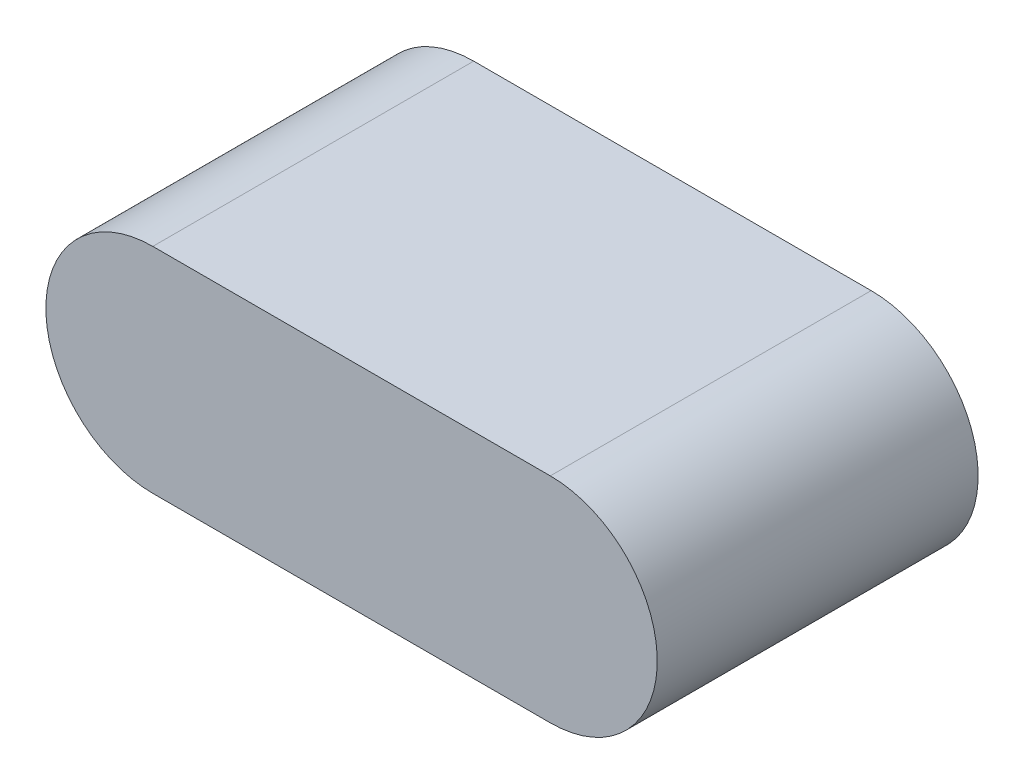
ISO-10303-21;
HEADER;
FILE_DESCRIPTION(('STEP AP214'),'2;1');
FILE_NAME('part.step','',(''),(''),'','','');
FILE_SCHEMA(('AUTOMOTIVE_DESIGN { 1 0 10303 214 1 1 1 1 }'));
ENDSEC;
DATA;
#1=APPLICATION_CONTEXT('core data for automotive mechanical design processes');
#2=APPLICATION_PROTOCOL_DEFINITION('international standard','automotive_design',2000,#1);
#3=PRODUCT_CONTEXT('',#1,'mechanical');
#4=PRODUCT('Part','Part','',(#3));
#5=PRODUCT_RELATED_PRODUCT_CATEGORY('part','',(#4));
#6=PRODUCT_DEFINITION_FORMATION('','',#4);
#7=PRODUCT_DEFINITION_CONTEXT('part definition',#1,'design');
#8=PRODUCT_DEFINITION('design','',#6,#7);
#9=PRODUCT_DEFINITION_SHAPE('','',#8);
#10=(LENGTH_UNIT() NAMED_UNIT(*) SI_UNIT(.MILLI.,.METRE.));
#11=(NAMED_UNIT(*) PLANE_ANGLE_UNIT() SI_UNIT($,.RADIAN.));
#12=(NAMED_UNIT(*) SI_UNIT($,.STERADIAN.) SOLID_ANGLE_UNIT());
#13=UNCERTAINTY_MEASURE_WITH_UNIT(LENGTH_MEASURE(1.E-05),#10,'distance_accuracy_value','');
#14=(GEOMETRIC_REPRESENTATION_CONTEXT(3) GLOBAL_UNCERTAINTY_ASSIGNED_CONTEXT((#13)) GLOBAL_UNIT_ASSIGNED_CONTEXT((#10,
#11,#12)) REPRESENTATION_CONTEXT('',''));
#15=CARTESIAN_POINT('',(0.,0.,0.));
#16=DIRECTION('',(0.,0.,1.));
#17=DIRECTION('',(1.,0.,0.));
#18=AXIS2_PLACEMENT_3D('',#15,#16,#17);
#19=CARTESIAN_POINT('',(-27.0763587627379,-14.5196168157461,3.));
#20=DIRECTION('',(0.,0.,-1.));
#21=DIRECTION('',(-1.,0.,0.));
#22=AXIS2_PLACEMENT_3D('',#19,#20,#21);
#23=CYLINDRICAL_SURFACE('',#22,1.);
#24=CARTESIAN_POINT('',(-27.0763587627379,-14.5196168157461,0.));
#25=DIRECTION('',(0.,0.,1.));
#26=DIRECTION('',(1.,0.,0.));
#27=AXIS2_PLACEMENT_3D('',#24,#25,#26);
#28=CIRCLE('',#27,1.);
#29=CARTESIAN_POINT('',(-27.0763587627379,-13.5196168157461,0.));
#30=VERTEX_POINT('',#29);
#31=CARTESIAN_POINT('',(-27.0763587627379,-15.5196168157461,0.));
#32=VERTEX_POINT('',#31);
#33=EDGE_CURVE('E97',#30,#32,#28,.T.);
#34=ORIENTED_EDGE('',*,*,#33,.T.);
#35=DIRECTION('',(0.,0.,-1.));
#36=VECTOR('',#35,1.);
#37=CARTESIAN_POINT('',(-27.0763587627379,-15.5196168157461,3.));
#38=LINE('',#37,#36);
#39=CARTESIAN_POINT('',(-27.0763587627379,-15.5196168157461,3.));
#40=VERTEX_POINT('',#39);
#41=EDGE_CURVE('E11',#40,#32,#38,.T.);
#42=ORIENTED_EDGE('',*,*,#41,.F.);
#43=CARTESIAN_POINT('',(-27.0763587627379,-14.5196168157461,3.));
#44=DIRECTION('',(0.,0.,1.));
#45=DIRECTION('',(1.,0.,0.));
#46=AXIS2_PLACEMENT_3D('',#43,#44,#45);
#47=CIRCLE('',#46,1.);
#48=CARTESIAN_POINT('',(-27.0763587627379,-13.5196168157461,3.));
#49=VERTEX_POINT('',#48);
#50=EDGE_CURVE('E85',#49,#40,#47,.T.);
#51=ORIENTED_EDGE('',*,*,#50,.F.);
#52=DIRECTION('',(0.,0.,-1.));
#53=VECTOR('',#52,1.);
#54=CARTESIAN_POINT('',(-27.0763587627379,-13.5196168157461,3.));
#55=LINE('',#54,#53);
#56=EDGE_CURVE('E93',#49,#30,#55,.T.);
#57=ORIENTED_EDGE('',*,*,#56,.T.);
#58=EDGE_LOOP('',(#34,#42,#51,#57));
#59=FACE_BOUND('',#58,.T.);
#60=ADVANCED_FACE('F34',(#59),#23,.T.);
#61=CARTESIAN_POINT('',(-27.0763587627379,-15.5196168157461,3.));
#62=DIRECTION('',(0.,1.,0.));
#63=DIRECTION('',(0.,0.,1.));
#64=AXIS2_PLACEMENT_3D('',#61,#62,#63);
#65=PLANE('',#64);
#66=DIRECTION('',(1.,0.,0.));
#67=VECTOR('',#66,1.);
#68=CARTESIAN_POINT('',(-27.0763587627379,-15.5196168157461,0.));
#69=LINE('',#68,#67);
#70=CARTESIAN_POINT('',(-23.3602049130118,-15.5196168157461,0.));
#71=VERTEX_POINT('',#70);
#72=EDGE_CURVE('E89',#32,#71,#69,.T.);
#73=ORIENTED_EDGE('',*,*,#72,.T.);
#74=DIRECTION('',(0.,0.,-1.));
#75=VECTOR('',#74,1.);
#76=CARTESIAN_POINT('',(-23.3602049130118,-15.5196168157461,3.));
#77=LINE('',#76,#75);
#78=CARTESIAN_POINT('',(-23.3602049130118,-15.5196168157461,3.));
#79=VERTEX_POINT('',#78);
#80=EDGE_CURVE('E42',#79,#71,#77,.T.);
#81=ORIENTED_EDGE('',*,*,#80,.F.);
#82=DIRECTION('',(1.,0.,0.));
#83=VECTOR('',#82,1.);
#84=CARTESIAN_POINT('',(-27.0763587627379,-15.5196168157461,3.));
#85=LINE('',#84,#83);
#86=EDGE_CURVE('E80',#40,#79,#85,.T.);
#87=ORIENTED_EDGE('',*,*,#86,.F.);
#88=ORIENTED_EDGE('',*,*,#41,.T.);
#89=EDGE_LOOP('',(#73,#81,#87,#88));
#90=FACE_BOUND('',#89,.T.);
#91=ADVANCED_FACE('F88',(#90),#65,.F.);
#92=CARTESIAN_POINT('',(-23.3602049130118,-14.5196168157461,3.));
#93=DIRECTION('',(0.,0.,-1.));
#94=DIRECTION('',(-1.,0.,0.));
#95=AXIS2_PLACEMENT_3D('',#92,#93,#94);
#96=CYLINDRICAL_SURFACE('',#95,1.);
#97=CARTESIAN_POINT('',(-23.3602049130118,-14.5196168157461,0.));
#98=DIRECTION('',(0.,0.,1.));
#99=DIRECTION('',(1.,0.,0.));
#100=AXIS2_PLACEMENT_3D('',#97,#98,#99);
#101=CIRCLE('',#100,1.);
#102=CARTESIAN_POINT('',(-23.3602049130118,-13.5196168157461,0.));
#103=VERTEX_POINT('',#102);
#104=EDGE_CURVE('E67',#71,#103,#101,.T.);
#105=ORIENTED_EDGE('',*,*,#104,.T.);
#106=DIRECTION('',(0.,0.,-1.));
#107=VECTOR('',#106,1.);
#108=CARTESIAN_POINT('',(-23.3602049130118,-13.5196168157461,3.));
#109=LINE('',#108,#107);
#110=CARTESIAN_POINT('',(-23.3602049130118,-13.5196168157461,3.));
#111=VERTEX_POINT('',#110);
#112=EDGE_CURVE('E90',#111,#103,#109,.T.);
#113=ORIENTED_EDGE('',*,*,#112,.F.);
#114=CARTESIAN_POINT('',(-23.3602049130118,-14.5196168157461,3.));
#115=DIRECTION('',(0.,0.,1.));
#116=DIRECTION('',(1.,0.,0.));
#117=AXIS2_PLACEMENT_3D('',#114,#115,#116);
#118=CIRCLE('',#117,1.);
#119=EDGE_CURVE('E83',#79,#111,#118,.T.);
#120=ORIENTED_EDGE('',*,*,#119,.F.);
#121=ORIENTED_EDGE('',*,*,#80,.T.);
#122=EDGE_LOOP('',(#105,#113,#120,#121));
#123=FACE_BOUND('',#122,.T.);
#124=ADVANCED_FACE('F91',(#123),#96,.T.);
#125=CARTESIAN_POINT('',(-27.0763587627379,-13.5196168157461,3.));
#126=DIRECTION('',(0.,-1.,0.));
#127=DIRECTION('',(0.,0.,-1.));
#128=AXIS2_PLACEMENT_3D('',#125,#126,#127);
#129=PLANE('',#128);
#130=DIRECTION('',(-1.,0.,0.));
#131=VECTOR('',#130,1.);
#132=CARTESIAN_POINT('',(-27.0763587627379,-13.5196168157461,0.));
#133=LINE('',#132,#131);
#134=EDGE_CURVE('E73',#103,#30,#133,.T.);
#135=ORIENTED_EDGE('',*,*,#134,.T.);
#136=ORIENTED_EDGE('',*,*,#56,.F.);
#137=DIRECTION('',(-1.,0.,0.));
#138=VECTOR('',#137,1.);
#139=CARTESIAN_POINT('',(-27.0763587627379,-13.5196168157461,3.));
#140=LINE('',#139,#138);
#141=EDGE_CURVE('E50',#111,#49,#140,.T.);
#142=ORIENTED_EDGE('',*,*,#141,.F.);
#143=ORIENTED_EDGE('',*,*,#112,.T.);
#144=EDGE_LOOP('',(#135,#136,#142,#143));
#145=FACE_BOUND('',#144,.T.);
#146=ADVANCED_FACE('F104',(#145),#129,.F.);
#147=CARTESIAN_POINT('',(-27.0763587627379,-14.5196168157461,3.));
#148=DIRECTION('',(0.,0.,1.));
#149=DIRECTION('',(1.,0.,0.));
#150=AXIS2_PLACEMENT_3D('',#147,#148,#149);
#151=PLANE('',#150);
#152=ORIENTED_EDGE('',*,*,#50,.T.);
#153=ORIENTED_EDGE('',*,*,#86,.T.);
#154=ORIENTED_EDGE('',*,*,#119,.T.);
#155=ORIENTED_EDGE('',*,*,#141,.T.);
#156=EDGE_LOOP('',(#152,#153,#154,#155));
#157=FACE_BOUND('',#156,.T.);
#158=ADVANCED_FACE('F81',(#157),#151,.T.);
#159=CARTESIAN_POINT('',(-27.0763587627379,-14.5196168157461,0.));
#160=DIRECTION('',(0.,0.,1.));
#161=DIRECTION('',(1.,0.,0.));
#162=AXIS2_PLACEMENT_3D('',#159,#160,#161);
#163=PLANE('',#162);
#164=ORIENTED_EDGE('',*,*,#33,.F.);
#165=ORIENTED_EDGE('',*,*,#134,.F.);
#166=ORIENTED_EDGE('',*,*,#104,.F.);
#167=ORIENTED_EDGE('',*,*,#72,.F.);
#168=EDGE_LOOP('',(#164,#165,#166,#167));
#169=FACE_BOUND('',#168,.T.);
#170=ADVANCED_FACE('F107',(#169),#163,.F.);
#171=CLOSED_SHELL('',(#60,#91,#124,#146,#158,#170));
#172=MANIFOLD_SOLID_BREP('B2',#171);
#173=ADVANCED_BREP_SHAPE_REPRESENTATION('',(#18,#172),#14);
#174=SHAPE_DEFINITION_REPRESENTATION(#9,#173);
ENDSEC;
END-ISO-10303-21;
